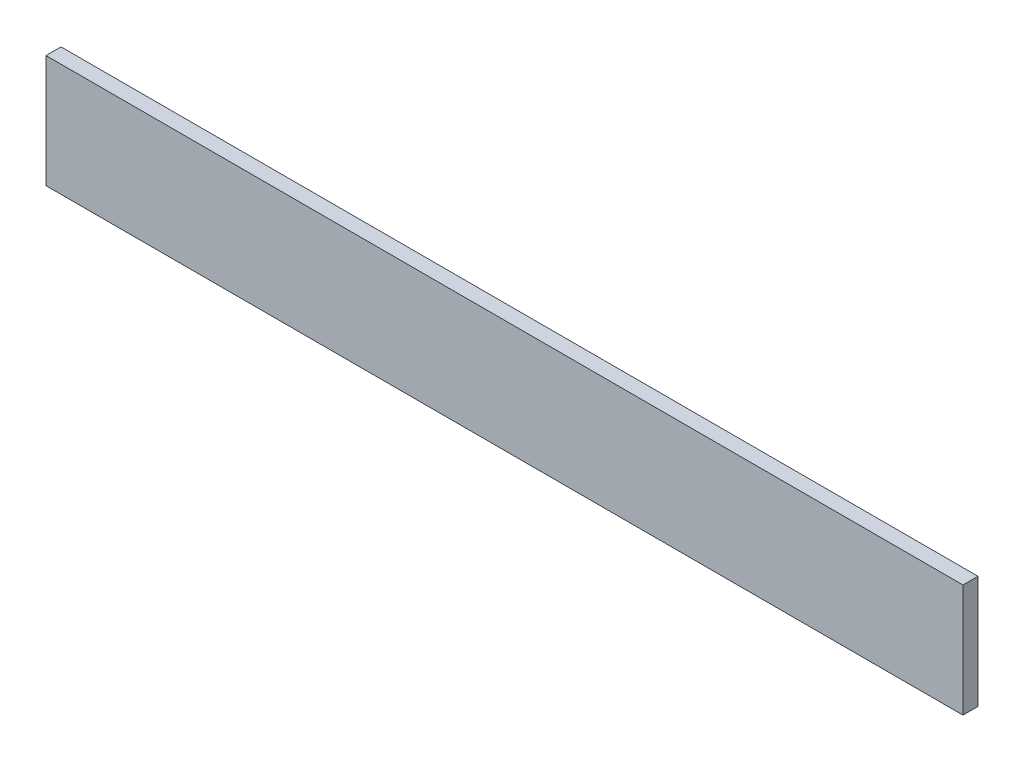
ISO-10303-21;
HEADER;
FILE_DESCRIPTION(('STEP AP214'),'2;1');
FILE_NAME('part.step','',(''),(''),'','','');
FILE_SCHEMA(('AUTOMOTIVE_DESIGN { 1 0 10303 214 1 1 1 1 }'));
ENDSEC;
DATA;
#1=APPLICATION_CONTEXT('core data for automotive mechanical design processes');
#2=APPLICATION_PROTOCOL_DEFINITION('international standard','automotive_design',2000,#1);
#3=PRODUCT_CONTEXT('',#1,'mechanical');
#4=PRODUCT('Part','Part','',(#3));
#5=PRODUCT_RELATED_PRODUCT_CATEGORY('part','',(#4));
#6=PRODUCT_DEFINITION_FORMATION('','',#4);
#7=PRODUCT_DEFINITION_CONTEXT('part definition',#1,'design');
#8=PRODUCT_DEFINITION('design','',#6,#7);
#9=PRODUCT_DEFINITION_SHAPE('','',#8);
#10=(LENGTH_UNIT() NAMED_UNIT(*) SI_UNIT(.MILLI.,.METRE.));
#11=(NAMED_UNIT(*) PLANE_ANGLE_UNIT() SI_UNIT($,.RADIAN.));
#12=(NAMED_UNIT(*) SI_UNIT($,.STERADIAN.) SOLID_ANGLE_UNIT());
#13=UNCERTAINTY_MEASURE_WITH_UNIT(LENGTH_MEASURE(1.E-05),#10,'distance_accuracy_value','');
#14=(GEOMETRIC_REPRESENTATION_CONTEXT(3) GLOBAL_UNCERTAINTY_ASSIGNED_CONTEXT((#13)) GLOBAL_UNIT_ASSIGNED_CONTEXT((#10,
#11,#12)) REPRESENTATION_CONTEXT('',''));
#15=CARTESIAN_POINT('',(0.,0.,0.));
#16=DIRECTION('',(0.,0.,1.));
#17=DIRECTION('',(1.,0.,0.));
#18=AXIS2_PLACEMENT_3D('',#15,#16,#17);
#19=CARTESIAN_POINT('',(0.,0.,2.));
#20=DIRECTION('',(1.,0.,0.));
#21=DIRECTION('',(0.,0.,-1.));
#22=AXIS2_PLACEMENT_3D('',#19,#20,#21);
#23=PLANE('',#22);
#24=DIRECTION('',(0.,-1.,0.));
#25=VECTOR('',#24,1.);
#26=CARTESIAN_POINT('',(0.,0.,0.));
#27=LINE('',#26,#25);
#28=CARTESIAN_POINT('',(0.,15.,0.));
#29=VERTEX_POINT('',#28);
#30=CARTESIAN_POINT('',(0.,0.,0.));
#31=VERTEX_POINT('',#30);
#32=EDGE_CURVE('E107',#29,#31,#27,.T.);
#33=ORIENTED_EDGE('',*,*,#32,.T.);
#34=DIRECTION('',(0.,0.,-1.));
#35=VECTOR('',#34,1.);
#36=CARTESIAN_POINT('',(0.,0.,2.));
#37=LINE('',#36,#35);
#38=CARTESIAN_POINT('',(0.,0.,2.));
#39=VERTEX_POINT('',#38);
#40=EDGE_CURVE('E11',#39,#31,#37,.T.);
#41=ORIENTED_EDGE('',*,*,#40,.F.);
#42=DIRECTION('',(0.,-1.,0.));
#43=VECTOR('',#42,1.);
#44=CARTESIAN_POINT('',(0.,0.,2.));
#45=LINE('',#44,#43);
#46=CARTESIAN_POINT('',(0.,15.,2.));
#47=VERTEX_POINT('',#46);
#48=EDGE_CURVE('E91',#47,#39,#45,.T.);
#49=ORIENTED_EDGE('',*,*,#48,.F.);
#50=DIRECTION('',(0.,0.,-1.));
#51=VECTOR('',#50,1.);
#52=CARTESIAN_POINT('',(0.,15.,2.));
#53=LINE('',#52,#51);
#54=EDGE_CURVE('E103',#47,#29,#53,.T.);
#55=ORIENTED_EDGE('',*,*,#54,.T.);
#56=EDGE_LOOP('',(#33,#41,#49,#55));
#57=FACE_BOUND('',#56,.T.);
#58=ADVANCED_FACE('F39',(#57),#23,.F.);
#59=CARTESIAN_POINT('',(0.,0.,2.));
#60=DIRECTION('',(0.,1.,0.));
#61=DIRECTION('',(0.,0.,1.));
#62=AXIS2_PLACEMENT_3D('',#59,#60,#61);
#63=PLANE('',#62);
#64=DIRECTION('',(1.,0.,0.));
#65=VECTOR('',#64,1.);
#66=CARTESIAN_POINT('',(0.,0.,0.));
#67=LINE('',#66,#65);
#68=CARTESIAN_POINT('',(122.,0.,0.));
#69=VERTEX_POINT('',#68);
#70=EDGE_CURVE('E96',#31,#69,#67,.T.);
#71=ORIENTED_EDGE('',*,*,#70,.T.);
#72=DIRECTION('',(0.,0.,-1.));
#73=VECTOR('',#72,1.);
#74=CARTESIAN_POINT('',(122.,0.,2.));
#75=LINE('',#74,#73);
#76=CARTESIAN_POINT('',(122.,0.,2.));
#77=VERTEX_POINT('',#76);
#78=EDGE_CURVE('E48',#77,#69,#75,.T.);
#79=ORIENTED_EDGE('',*,*,#78,.F.);
#80=DIRECTION('',(1.,0.,0.));
#81=VECTOR('',#80,1.);
#82=CARTESIAN_POINT('',(0.,0.,2.));
#83=LINE('',#82,#81);
#84=EDGE_CURVE('E86',#39,#77,#83,.T.);
#85=ORIENTED_EDGE('',*,*,#84,.F.);
#86=ORIENTED_EDGE('',*,*,#40,.T.);
#87=EDGE_LOOP('',(#71,#79,#85,#86));
#88=FACE_BOUND('',#87,.T.);
#89=ADVANCED_FACE('F95',(#88),#63,.F.);
#90=CARTESIAN_POINT('',(122.,0.,2.));
#91=DIRECTION('',(-1.,0.,0.));
#92=DIRECTION('',(0.,0.,1.));
#93=AXIS2_PLACEMENT_3D('',#90,#91,#92);
#94=PLANE('',#93);
#95=DIRECTION('',(0.,1.,0.));
#96=VECTOR('',#95,1.);
#97=CARTESIAN_POINT('',(122.,0.,0.));
#98=LINE('',#97,#96);
#99=CARTESIAN_POINT('',(122.,15.,0.));
#100=VERTEX_POINT('',#99);
#101=EDGE_CURVE('E73',#69,#100,#98,.T.);
#102=ORIENTED_EDGE('',*,*,#101,.T.);
#103=DIRECTION('',(0.,0.,-1.));
#104=VECTOR('',#103,1.);
#105=CARTESIAN_POINT('',(122.,15.,2.));
#106=LINE('',#105,#104);
#107=CARTESIAN_POINT('',(122.,15.,2.));
#108=VERTEX_POINT('',#107);
#109=EDGE_CURVE('E98',#108,#100,#106,.T.);
#110=ORIENTED_EDGE('',*,*,#109,.F.);
#111=DIRECTION('',(0.,1.,0.));
#112=VECTOR('',#111,1.);
#113=CARTESIAN_POINT('',(122.,0.,2.));
#114=LINE('',#113,#112);
#115=EDGE_CURVE('E89',#77,#108,#114,.T.);
#116=ORIENTED_EDGE('',*,*,#115,.F.);
#117=ORIENTED_EDGE('',*,*,#78,.T.);
#118=EDGE_LOOP('',(#102,#110,#116,#117));
#119=FACE_BOUND('',#118,.T.);
#120=ADVANCED_FACE('F99',(#119),#94,.F.);
#121=CARTESIAN_POINT('',(0.,15.,2.));
#122=DIRECTION('',(0.,-1.,0.));
#123=DIRECTION('',(0.,0.,-1.));
#124=AXIS2_PLACEMENT_3D('',#121,#122,#123);
#125=PLANE('',#124);
#126=DIRECTION('',(-1.,0.,0.));
#127=VECTOR('',#126,1.);
#128=CARTESIAN_POINT('',(0.,15.,0.));
#129=LINE('',#128,#127);
#130=EDGE_CURVE('E79',#100,#29,#129,.T.);
#131=ORIENTED_EDGE('',*,*,#130,.T.);
#132=ORIENTED_EDGE('',*,*,#54,.F.);
#133=DIRECTION('',(-1.,0.,0.));
#134=VECTOR('',#133,1.);
#135=CARTESIAN_POINT('',(0.,15.,2.));
#136=LINE('',#135,#134);
#137=EDGE_CURVE('E56',#108,#47,#136,.T.);
#138=ORIENTED_EDGE('',*,*,#137,.F.);
#139=ORIENTED_EDGE('',*,*,#109,.T.);
#140=EDGE_LOOP('',(#131,#132,#138,#139));
#141=FACE_BOUND('',#140,.T.);
#142=ADVANCED_FACE('F120',(#141),#125,.F.);
#143=CARTESIAN_POINT('',(0.,0.,2.));
#144=DIRECTION('',(0.,0.,-1.));
#145=DIRECTION('',(-1.,0.,0.));
#146=AXIS2_PLACEMENT_3D('',#143,#144,#145);
#147=PLANE('',#146);
#148=ORIENTED_EDGE('',*,*,#48,.T.);
#149=ORIENTED_EDGE('',*,*,#84,.T.);
#150=ORIENTED_EDGE('',*,*,#115,.T.);
#151=ORIENTED_EDGE('',*,*,#137,.T.);
#152=EDGE_LOOP('',(#148,#149,#150,#151));
#153=FACE_BOUND('',#152,.T.);
#154=ADVANCED_FACE('F87',(#153),#147,.F.);
#155=CARTESIAN_POINT('',(0.,0.,0.));
#156=DIRECTION('',(0.,0.,-1.));
#157=DIRECTION('',(-1.,0.,0.));
#158=AXIS2_PLACEMENT_3D('',#155,#156,#157);
#159=PLANE('',#158);
#160=ORIENTED_EDGE('',*,*,#32,.F.);
#161=ORIENTED_EDGE('',*,*,#130,.F.);
#162=ORIENTED_EDGE('',*,*,#101,.F.);
#163=ORIENTED_EDGE('',*,*,#70,.F.);
#164=EDGE_LOOP('',(#160,#161,#162,#163));
#165=FACE_BOUND('',#164,.T.);
#166=ADVANCED_FACE('F123',(#165),#159,.T.);
#167=CLOSED_SHELL('',(#58,#89,#120,#142,#154,#166));
#168=MANIFOLD_SOLID_BREP('B2',#167);
#169=ADVANCED_BREP_SHAPE_REPRESENTATION('',(#18,#168),#14);
#170=SHAPE_DEFINITION_REPRESENTATION(#9,#169);
ENDSEC;
END-ISO-10303-21;
